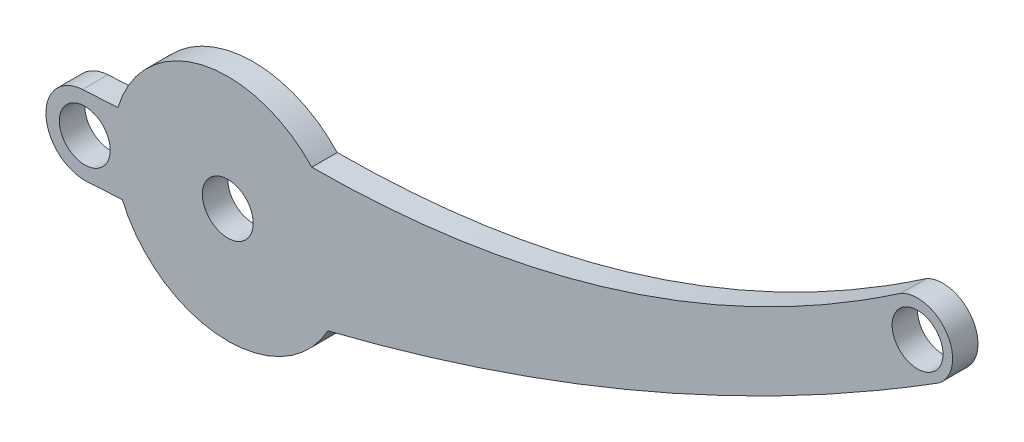
ISO-10303-21;
HEADER;
FILE_DESCRIPTION(('STEP AP214'),'2;1');
FILE_NAME('part.step','',(''),(''),'','','');
FILE_SCHEMA(('AUTOMOTIVE_DESIGN { 1 0 10303 214 1 1 1 1 }'));
ENDSEC;
DATA;
#1=APPLICATION_CONTEXT('core data for automotive mechanical design processes');
#2=APPLICATION_PROTOCOL_DEFINITION('international standard','automotive_design',2000,#1);
#3=PRODUCT_CONTEXT('',#1,'mechanical');
#4=PRODUCT('Part','Part','',(#3));
#5=PRODUCT_RELATED_PRODUCT_CATEGORY('part','',(#4));
#6=PRODUCT_DEFINITION_FORMATION('','',#4);
#7=PRODUCT_DEFINITION_CONTEXT('part definition',#1,'design');
#8=PRODUCT_DEFINITION('design','',#6,#7);
#9=PRODUCT_DEFINITION_SHAPE('','',#8);
#10=(LENGTH_UNIT() NAMED_UNIT(*) SI_UNIT(.MILLI.,.METRE.));
#11=(NAMED_UNIT(*) PLANE_ANGLE_UNIT() SI_UNIT($,.RADIAN.));
#12=(NAMED_UNIT(*) SI_UNIT($,.STERADIAN.) SOLID_ANGLE_UNIT());
#13=UNCERTAINTY_MEASURE_WITH_UNIT(LENGTH_MEASURE(1.E-05),#10,'distance_accuracy_value','');
#14=(GEOMETRIC_REPRESENTATION_CONTEXT(3) GLOBAL_UNCERTAINTY_ASSIGNED_CONTEXT((#13)) GLOBAL_UNIT_ASSIGNED_CONTEXT((#10,
#11,#12)) REPRESENTATION_CONTEXT('',''));
#15=CARTESIAN_POINT('',(0.,0.,0.));
#16=DIRECTION('',(0.,0.,1.));
#17=DIRECTION('',(1.,0.,0.));
#18=AXIS2_PLACEMENT_3D('',#15,#16,#17);
#19=CARTESIAN_POINT('',(0.,0.,-2.));
#20=DIRECTION('',(0.,0.,1.));
#21=DIRECTION('',(1.,0.,0.));
#22=AXIS2_PLACEMENT_3D('',#19,#20,#21);
#23=PLANE('',#22);
#24=CARTESIAN_POINT('',(0.,0.,-2.));
#25=DIRECTION('',(0.,0.,1.));
#26=DIRECTION('',(1.,0.,0.));
#27=AXIS2_PLACEMENT_3D('',#24,#25,#26);
#28=CIRCLE('',#27,4.);
#29=CARTESIAN_POINT('',(4.,0.,-2.));
#30=VERTEX_POINT('',#29);
#31=EDGE_CURVE('E177',#30,#30,#28,.T.);
#32=ORIENTED_EDGE('',*,*,#31,.T.);
#33=EDGE_LOOP('',(#32));
#34=FACE_BOUND('',#33,.T.);
#35=CARTESIAN_POINT('',(0.,0.,-2.));
#36=DIRECTION('',(0.,0.,1.));
#37=DIRECTION('',(1.,0.,0.));
#38=AXIS2_PLACEMENT_3D('',#35,#36,#37);
#39=CIRCLE('',#38,4.8);
#40=CARTESIAN_POINT('',(4.8,0.,-2.));
#41=VERTEX_POINT('',#40);
#42=EDGE_CURVE('E234',#41,#41,#39,.T.);
#43=ORIENTED_EDGE('',*,*,#42,.F.);
#44=EDGE_LOOP('',(#43));
#45=FACE_BOUND('',#44,.T.);
#46=ADVANCED_FACE('F33',(#34,#45),#23,.F.);
#47=CARTESIAN_POINT('',(-22.4867612509429,-1.28341643429853,-2.));
#48=DIRECTION('',(0.,0.,1.));
#49=DIRECTION('',(1.,0.,0.));
#50=AXIS2_PLACEMENT_3D('',#47,#48,#49);
#51=CIRCLE('',#50,4.);
#52=CARTESIAN_POINT('',(-18.4867612509429,-1.28341643429853,-2.));
#53=VERTEX_POINT('',#52);
#54=EDGE_CURVE('E186',#53,#53,#51,.T.);
#55=ORIENTED_EDGE('',*,*,#54,.T.);
#56=EDGE_LOOP('',(#55));
#57=FACE_BOUND('',#56,.T.);
#58=CARTESIAN_POINT('',(-22.4867612509429,-1.28341643429853,-2.));
#59=DIRECTION('',(0.,0.,1.));
#60=DIRECTION('',(1.,0.,0.));
#61=AXIS2_PLACEMENT_3D('',#58,#59,#60);
#62=CIRCLE('',#61,4.8);
#63=CARTESIAN_POINT('',(-17.6867612509429,-1.28341643429853,-2.));
#64=VERTEX_POINT('',#63);
#65=EDGE_CURVE('E229',#64,#64,#62,.T.);
#66=ORIENTED_EDGE('',*,*,#65,.F.);
#67=EDGE_LOOP('',(#66));
#68=FACE_BOUND('',#67,.T.);
#69=ADVANCED_FACE('F405',(#57,#68),#23,.F.);
#70=CARTESIAN_POINT('',(0.,0.,2.));
#71=DIRECTION('',(0.,0.,-1.));
#72=DIRECTION('',(-1.,0.,0.));
#73=AXIS2_PLACEMENT_3D('',#70,#71,#72);
#74=CYLINDRICAL_SURFACE('',#73,18.0203);
#75=CARTESIAN_POINT('',(0.,0.,-2.));
#76=DIRECTION('',(0.,0.,1.));
#77=DIRECTION('',(1.,0.,0.));
#78=AXIS2_PLACEMENT_3D('',#75,#76,#77);
#79=CIRCLE('',#78,18.0203);
#80=CARTESIAN_POINT('',(13.2124542812011,12.2540713216943,-2.));
#81=VERTEX_POINT('',#80);
#82=CARTESIAN_POINT('',(-17.273333041781,5.13450851763995,-2.));
#83=VERTEX_POINT('',#82);
#84=EDGE_CURVE('E153',#81,#83,#79,.T.);
#85=ORIENTED_EDGE('',*,*,#84,.T.);
#86=DIRECTION('',(0.,0.,-1.));
#87=VECTOR('',#86,1.);
#88=CARTESIAN_POINT('',(-17.273333041781,5.13450851763995,2.));
#89=LINE('',#88,#87);
#90=CARTESIAN_POINT('',(-17.273333041781,5.13450851763995,2.));
#91=VERTEX_POINT('',#90);
#92=EDGE_CURVE('E11',#91,#83,#89,.T.);
#93=ORIENTED_EDGE('',*,*,#92,.F.);
#94=CARTESIAN_POINT('',(0.,0.,2.));
#95=DIRECTION('',(0.,0.,1.));
#96=DIRECTION('',(1.,0.,0.));
#97=AXIS2_PLACEMENT_3D('',#94,#95,#96);
#98=CIRCLE('',#97,18.0203);
#99=CARTESIAN_POINT('',(13.2124542812011,12.2540713216943,2.));
#100=VERTEX_POINT('',#99);
#101=EDGE_CURVE('E95',#100,#91,#98,.T.);
#102=ORIENTED_EDGE('',*,*,#101,.F.);
#103=DIRECTION('',(0.,0.,-1.));
#104=VECTOR('',#103,1.);
#105=CARTESIAN_POINT('',(13.2124542812011,12.2540713216943,2.));
#106=LINE('',#105,#104);
#107=EDGE_CURVE('E57',#100,#81,#106,.T.);
#108=ORIENTED_EDGE('',*,*,#107,.T.);
#109=EDGE_LOOP('',(#85,#93,#102,#108));
#110=FACE_BOUND('',#109,.T.);
#111=ADVANCED_FACE('F212',(#110),#74,.T.);
#112=CARTESIAN_POINT('',(-0.348181835540796,6.10049988334476,2.));
#113=DIRECTION('',(-0.0569815796631457,0.998375229850527,0.));
#114=DIRECTION('',(-0.998375229850527,-0.0569815796631457,0.));
#115=AXIS2_PLACEMENT_3D('',#112,#113,#114);
#116=PLANE('',#115);
#117=DIRECTION('',(0.998375229850527,0.0569815796631457,0.));
#118=VECTOR('',#117,1.);
#119=CARTESIAN_POINT('',(-0.348181835540796,6.10049988334476,-2.));
#120=LINE('',#119,#118);
#121=CARTESIAN_POINT('',(-22.8349430864837,4.81708344904622,-2.));
#122=VERTEX_POINT('',#121);
#123=EDGE_CURVE('E155',#122,#83,#120,.T.);
#124=ORIENTED_EDGE('',*,*,#123,.F.);
#125=DIRECTION('',(0.,0.,-1.));
#126=VECTOR('',#125,1.);
#127=CARTESIAN_POINT('',(-22.8349430864837,4.81708344904622,2.));
#128=LINE('',#127,#126);
#129=CARTESIAN_POINT('',(-22.8349430864837,4.81708344904622,2.));
#130=VERTEX_POINT('',#129);
#131=EDGE_CURVE('E41',#130,#122,#128,.T.);
#132=ORIENTED_EDGE('',*,*,#131,.F.);
#133=DIRECTION('',(0.998375229850527,0.0569815796631457,0.));
#134=VECTOR('',#133,1.);
#135=CARTESIAN_POINT('',(-0.348181835540796,6.10049988334476,2.));
#136=LINE('',#135,#134);
#137=EDGE_CURVE('E211',#130,#91,#136,.T.);
#138=ORIENTED_EDGE('',*,*,#137,.T.);
#139=ORIENTED_EDGE('',*,*,#92,.T.);
#140=EDGE_LOOP('',(#124,#132,#138,#139));
#141=FACE_BOUND('',#140,.T.);
#142=ADVANCED_FACE('F35',(#141),#116,.T.);
#143=CARTESIAN_POINT('',(-22.4867612509429,-1.28341643429853,2.));
#144=DIRECTION('',(0.,0.,-1.));
#145=DIRECTION('',(-1.,0.,0.));
#146=AXIS2_PLACEMENT_3D('',#143,#144,#145);
#147=CYLINDRICAL_SURFACE('',#146,6.11042792423656);
#148=CARTESIAN_POINT('',(-22.4867612509429,-1.28341643429853,-2.));
#149=DIRECTION('',(0.,0.,1.));
#150=DIRECTION('',(1.,0.,0.));
#151=AXIS2_PLACEMENT_3D('',#148,#149,#150);
#152=CIRCLE('',#151,6.11042792423656);
#153=CARTESIAN_POINT('',(-22.1385794154021,-7.38391631764329,-2.));
#154=VERTEX_POINT('',#153);
#155=EDGE_CURVE('E160',#122,#154,#152,.T.);
#156=ORIENTED_EDGE('',*,*,#155,.T.);
#157=DIRECTION('',(0.,0.,-1.));
#158=VECTOR('',#157,1.);
#159=CARTESIAN_POINT('',(-22.1385794154021,-7.38391631764329,2.));
#160=LINE('',#159,#158);
#161=CARTESIAN_POINT('',(-22.1385794154021,-7.38391631764329,2.));
#162=VERTEX_POINT('',#161);
#163=EDGE_CURVE('E195',#162,#154,#160,.T.);
#164=ORIENTED_EDGE('',*,*,#163,.F.);
#165=CARTESIAN_POINT('',(-22.4867612509429,-1.28341643429853,2.));
#166=DIRECTION('',(0.,0.,1.));
#167=DIRECTION('',(1.,0.,0.));
#168=AXIS2_PLACEMENT_3D('',#165,#166,#167);
#169=CIRCLE('',#168,6.11042792423656);
#170=EDGE_CURVE('E202',#130,#162,#169,.T.);
#171=ORIENTED_EDGE('',*,*,#170,.F.);
#172=ORIENTED_EDGE('',*,*,#131,.T.);
#173=EDGE_LOOP('',(#156,#164,#171,#172));
#174=FACE_BOUND('',#173,.T.);
#175=ADVANCED_FACE('F200',(#174),#147,.T.);
#176=CARTESIAN_POINT('',(0.348181835540796,-6.10049988334476,2.));
#177=DIRECTION('',(-0.0569815796631458,0.998375229850527,0.));
#178=DIRECTION('',(-0.998375229850527,-0.0569815796631458,0.));
#179=AXIS2_PLACEMENT_3D('',#176,#177,#178);
#180=PLANE('',#179);
#181=DIRECTION('',(0.998375229850527,0.0569815796631458,0.));
#182=VECTOR('',#181,1.);
#183=CARTESIAN_POINT('',(0.348181835540796,-6.10049988334476,-2.));
#184=LINE('',#183,#182);
#185=CARTESIAN_POINT('',(-16.5769693706994,-7.06649124904957,-2.));
#186=VERTEX_POINT('',#185);
#187=EDGE_CURVE('E162',#154,#186,#184,.T.);
#188=ORIENTED_EDGE('',*,*,#187,.T.);
#189=DIRECTION('',(0.,0.,-1.));
#190=VECTOR('',#189,1.);
#191=CARTESIAN_POINT('',(-16.5769693706994,-7.06649124904957,2.));
#192=LINE('',#191,#190);
#193=CARTESIAN_POINT('',(-16.5769693706994,-7.06649124904957,2.));
#194=VERTEX_POINT('',#193);
#195=EDGE_CURVE('E192',#194,#186,#192,.T.);
#196=ORIENTED_EDGE('',*,*,#195,.F.);
#197=DIRECTION('',(0.998375229850527,0.0569815796631458,0.));
#198=VECTOR('',#197,1.);
#199=CARTESIAN_POINT('',(0.348181835540796,-6.10049988334476,2.));
#200=LINE('',#199,#198);
#201=EDGE_CURVE('E143',#162,#194,#200,.T.);
#202=ORIENTED_EDGE('',*,*,#201,.F.);
#203=ORIENTED_EDGE('',*,*,#163,.T.);
#204=EDGE_LOOP('',(#188,#196,#202,#203));
#205=FACE_BOUND('',#204,.T.);
#206=ADVANCED_FACE('F219',(#205),#180,.F.);
#207=CARTESIAN_POINT('',(15.7458990999388,-8.76343960009698,-2.));
#208=VERTEX_POINT('',#207);
#209=EDGE_CURVE('E157',#186,#208,#79,.T.);
#210=ORIENTED_EDGE('',*,*,#209,.T.);
#211=DIRECTION('',(0.,0.,-1.));
#212=VECTOR('',#211,1.);
#213=CARTESIAN_POINT('',(15.7458990999388,-8.76343960009698,2.));
#214=LINE('',#213,#212);
#215=CARTESIAN_POINT('',(15.7458990999388,-8.76343960009698,2.));
#216=VERTEX_POINT('',#215);
#217=EDGE_CURVE('E133',#216,#208,#214,.T.);
#218=ORIENTED_EDGE('',*,*,#217,.F.);
#219=EDGE_CURVE('E120',#194,#216,#98,.T.);
#220=ORIENTED_EDGE('',*,*,#219,.F.);
#221=ORIENTED_EDGE('',*,*,#195,.T.);
#222=EDGE_LOOP('',(#210,#218,#220,#221));
#223=FACE_BOUND('',#222,.T.);
#224=ADVANCED_FACE('F215',(#223),#74,.T.);
#225=CARTESIAN_POINT('',(14.7191388942277,-9.01954009833308,2.));
#226=CARTESIAN_POINT('',(15.2325189970833,-8.89148984921503,2.));
#227=CARTESIAN_POINT('',(15.7458990999388,-8.76343960009698,2.));
#228=CARTESIAN_POINT('',(67.0839093854893,4.0415853117079,2.));
#229=CARTESIAN_POINT('',(111.853607552858,32.1932057551996,2.));
#230=B_SPLINE_CURVE_WITH_KNOTS('',2,(#225,#226,#227,#228,#229),.UNSPECIFIED.,.F.,.F.,(3,2,3),
(-0.01,0.,1.),.UNSPECIFIED.);
#231=DIRECTION('',(0.,0.,-1.));
#232=VECTOR('',#231,1.);
#233=SURFACE_OF_LINEAR_EXTRUSION('',#230,#232);
#234=CARTESIAN_POINT('',(15.7458990999388,-8.76343960009698,-2.));
#235=CARTESIAN_POINT('',(67.0839093854893,4.0415853117079,-2.));
#236=CARTESIAN_POINT('',(111.853607552858,32.1932057551996,-2.));
#237=B_SPLINE_CURVE_WITH_KNOTS('',2,(#234,#235,#236),.UNSPECIFIED.,.F.,.F.,(3,3),(0.,1.),.UNSPECIFIED.);
#238=CARTESIAN_POINT('',(111.853607552858,32.1932057551996,-2.));
#239=VERTEX_POINT('',#238);
#240=EDGE_CURVE('E129',#208,#239,#237,.T.);
#241=ORIENTED_EDGE('',*,*,#240,.T.);
#242=DIRECTION('',(0.,0.,-1.));
#243=VECTOR('',#242,1.);
#244=CARTESIAN_POINT('',(111.853607552858,32.1932057551996,2.));
#245=LINE('',#244,#243);
#246=CARTESIAN_POINT('',(111.853607552858,32.1932057551996,2.));
#247=VERTEX_POINT('',#246);
#248=EDGE_CURVE('E126',#247,#239,#245,.T.);
#249=ORIENTED_EDGE('',*,*,#248,.F.);
#250=EDGE_CURVE('E112',#216,#247,#230,.T.);
#251=ORIENTED_EDGE('',*,*,#250,.F.);
#252=ORIENTED_EDGE('',*,*,#217,.T.);
#253=EDGE_LOOP('',(#241,#249,#251,#252));
#254=FACE_BOUND('',#253,.T.);
#255=ADVANCED_FACE('F127',(#254),#233,.F.);
#256=CARTESIAN_POINT('',(108.467020379199,36.5528887009727,2.));
#257=DIRECTION('',(0.,0.,-1.));
#258=DIRECTION('',(-1.,0.,0.));
#259=AXIS2_PLACEMENT_3D('',#256,#257,#258);
#260=CYLINDRICAL_SURFACE('',#259,5.52048983990184);
#261=CARTESIAN_POINT('',(108.467020379199,36.5528887009727,-2.));
#262=DIRECTION('',(0.,0.,1.));
#263=DIRECTION('',(1.,0.,0.));
#264=AXIS2_PLACEMENT_3D('',#261,#262,#263);
#265=CIRCLE('',#264,5.52048983990184);
#266=CARTESIAN_POINT('',(105.896265572367,41.4382779173619,-2.));
#267=VERTEX_POINT('',#266);
#268=EDGE_CURVE('E167',#239,#267,#265,.T.);
#269=ORIENTED_EDGE('',*,*,#268,.T.);
#270=DIRECTION('',(0.,0.,-1.));
#271=VECTOR('',#270,1.);
#272=CARTESIAN_POINT('',(105.896265572367,41.4382779173619,2.));
#273=LINE('',#272,#271);
#274=CARTESIAN_POINT('',(105.896265572367,41.4382779173619,2.));
#275=VERTEX_POINT('',#274);
#276=EDGE_CURVE('E134',#275,#267,#273,.T.);
#277=ORIENTED_EDGE('',*,*,#276,.F.);
#278=CARTESIAN_POINT('',(108.467020379199,36.5528887009727,2.));
#279=DIRECTION('',(0.,0.,1.));
#280=DIRECTION('',(1.,0.,0.));
#281=AXIS2_PLACEMENT_3D('',#278,#279,#280);
#282=CIRCLE('',#281,5.52048983990184);
#283=EDGE_CURVE('E117',#247,#275,#282,.T.);
#284=ORIENTED_EDGE('',*,*,#283,.F.);
#285=ORIENTED_EDGE('',*,*,#248,.T.);
#286=EDGE_LOOP('',(#269,#277,#284,#285));
#287=FACE_BOUND('',#286,.T.);
#288=ADVANCED_FACE('F136',(#287),#260,.T.);
#289=CARTESIAN_POINT('',(108.469927907344,36.4086715831056,2.));
#290=DIRECTION('',(0.,0.,-1.));
#291=DIRECTION('',(-1.,0.,0.));
#292=AXIS2_PLACEMENT_3D('',#289,#290,#291);
#293=CYLINDRICAL_SURFACE('',#292,4.00000000000001);
#294=CARTESIAN_POINT('',(108.469927907344,36.4086715831056,2.));
#295=DIRECTION('',(0.,0.,1.));
#296=DIRECTION('',(1.,0.,0.));
#297=AXIS2_PLACEMENT_3D('',#294,#295,#296);
#298=CIRCLE('',#297,4.00000000000001);
#299=CARTESIAN_POINT('',(112.469927907344,36.4086715831056,2.));
#300=VERTEX_POINT('',#299);
#301=EDGE_CURVE('E147',#300,#300,#298,.T.);
#302=ORIENTED_EDGE('',*,*,#301,.T.);
#303=EDGE_LOOP('',(#302));
#304=FACE_BOUND('',#303,.T.);
#305=CARTESIAN_POINT('',(108.469927907344,36.4086715831056,-2.));
#306=DIRECTION('',(0.,0.,1.));
#307=DIRECTION('',(1.,0.,0.));
#308=AXIS2_PLACEMENT_3D('',#305,#306,#307);
#309=CIRCLE('',#308,4.00000000000001);
#310=CARTESIAN_POINT('',(112.469927907344,36.4086715831056,-2.));
#311=VERTEX_POINT('',#310);
#312=EDGE_CURVE('E183',#311,#311,#309,.T.);
#313=ORIENTED_EDGE('',*,*,#312,.F.);
#314=EDGE_LOOP('',(#313));
#315=FACE_BOUND('',#314,.T.);
#316=ADVANCED_FACE('F401',(#304,#315),#293,.F.);
#317=CARTESIAN_POINT('',(0.,0.,2.));
#318=DIRECTION('',(0.,0.,-1.));
#319=DIRECTION('',(-1.,0.,0.));
#320=AXIS2_PLACEMENT_3D('',#317,#318,#319);
#321=CYLINDRICAL_SURFACE('',#320,4.);
#322=CARTESIAN_POINT('',(0.,0.,2.));
#323=DIRECTION('',(0.,0.,1.));
#324=DIRECTION('',(1.,0.,0.));
#325=AXIS2_PLACEMENT_3D('',#322,#323,#324);
#326=CIRCLE('',#325,4.);
#327=CARTESIAN_POINT('',(4.,0.,2.));
#328=VERTEX_POINT('',#327);
#329=EDGE_CURVE('E139',#328,#328,#326,.T.);
#330=ORIENTED_EDGE('',*,*,#329,.T.);
#331=EDGE_LOOP('',(#330));
#332=FACE_BOUND('',#331,.T.);
#333=ORIENTED_EDGE('',*,*,#31,.F.);
#334=EDGE_LOOP('',(#333));
#335=FACE_BOUND('',#334,.T.);
#336=ADVANCED_FACE('F579',(#332,#335),#321,.F.);
#337=CARTESIAN_POINT('',(12.2061843026016,12.2506708359892,2.));
#338=CARTESIAN_POINT('',(12.7093192919014,12.2523710788417,2.));
#339=CARTESIAN_POINT('',(13.2124542812011,12.2540713216943,2.));
#340=CARTESIAN_POINT('',(63.5259532111759,12.4240956069503,2.));
#341=CARTESIAN_POINT('',(105.896265572367,41.438277917362,2.));
#342=B_SPLINE_CURVE_WITH_KNOTS('',2,(#337,#338,#339,#340,#341),.UNSPECIFIED.,.F.,.F.,(3,2,3),
(-0.01,0.,1.),.UNSPECIFIED.);
#343=DIRECTION('',(0.,0.,-1.));
#344=VECTOR('',#343,1.);
#345=SURFACE_OF_LINEAR_EXTRUSION('',#342,#344);
#346=CARTESIAN_POINT('',(13.2124542812011,12.2540713216943,-2.));
#347=CARTESIAN_POINT('',(63.5259532111759,12.4240956069503,-2.));
#348=CARTESIAN_POINT('',(105.896265572367,41.438277917362,-2.));
#349=B_SPLINE_CURVE_WITH_KNOTS('',2,(#346,#347,#348),.UNSPECIFIED.,.F.,.F.,(3,3),(0.,1.),.UNSPECIFIED.);
#350=EDGE_CURVE('E172',#81,#267,#349,.T.);
#351=ORIENTED_EDGE('',*,*,#350,.F.);
#352=ORIENTED_EDGE('',*,*,#107,.F.);
#353=EDGE_CURVE('E137',#100,#275,#342,.T.);
#354=ORIENTED_EDGE('',*,*,#353,.T.);
#355=ORIENTED_EDGE('',*,*,#276,.T.);
#356=EDGE_LOOP('',(#351,#352,#354,#355));
#357=FACE_BOUND('',#356,.T.);
#358=ADVANCED_FACE('F213',(#357),#345,.T.);
#359=CARTESIAN_POINT('',(-22.4867612509429,-1.28341643429853,2.));
#360=DIRECTION('',(0.,0.,-1.));
#361=DIRECTION('',(-1.,0.,0.));
#362=AXIS2_PLACEMENT_3D('',#359,#360,#361);
#363=CYLINDRICAL_SURFACE('',#362,4.);
#364=CARTESIAN_POINT('',(-22.4867612509429,-1.28341643429853,2.));
#365=DIRECTION('',(0.,0.,1.));
#366=DIRECTION('',(1.,0.,0.));
#367=AXIS2_PLACEMENT_3D('',#364,#365,#366);
#368=CIRCLE('',#367,4.);
#369=CARTESIAN_POINT('',(-18.4867612509429,-1.28341643429853,2.));
#370=VERTEX_POINT('',#369);
#371=EDGE_CURVE('E150',#370,#370,#368,.T.);
#372=ORIENTED_EDGE('',*,*,#371,.T.);
#373=EDGE_LOOP('',(#372));
#374=FACE_BOUND('',#373,.T.);
#375=ORIENTED_EDGE('',*,*,#54,.F.);
#376=EDGE_LOOP('',(#375));
#377=FACE_BOUND('',#376,.T.);
#378=ADVANCED_FACE('F422',(#374,#377),#363,.F.);
#379=CARTESIAN_POINT('',(0.,0.,2.));
#380=DIRECTION('',(0.,0.,1.));
#381=DIRECTION('',(1.,0.,0.));
#382=AXIS2_PLACEMENT_3D('',#379,#380,#381);
#383=PLANE('',#382);
#384=ORIENTED_EDGE('',*,*,#101,.T.);
#385=ORIENTED_EDGE('',*,*,#137,.F.);
#386=ORIENTED_EDGE('',*,*,#170,.T.);
#387=ORIENTED_EDGE('',*,*,#201,.T.);
#388=ORIENTED_EDGE('',*,*,#219,.T.);
#389=ORIENTED_EDGE('',*,*,#250,.T.);
#390=ORIENTED_EDGE('',*,*,#283,.T.);
#391=ORIENTED_EDGE('',*,*,#353,.F.);
#392=EDGE_LOOP('',(#384,#385,#386,#387,#388,#389,#390,#391));
#393=FACE_BOUND('',#392,.T.);
#394=ORIENTED_EDGE('',*,*,#329,.F.);
#395=EDGE_LOOP('',(#394));
#396=FACE_BOUND('',#395,.T.);
#397=ORIENTED_EDGE('',*,*,#301,.F.);
#398=EDGE_LOOP('',(#397));
#399=FACE_BOUND('',#398,.T.);
#400=ORIENTED_EDGE('',*,*,#371,.F.);
#401=EDGE_LOOP('',(#400));
#402=FACE_BOUND('',#401,.T.);
#403=ADVANCED_FACE('F114',(#393,#396,#399,#402),#383,.T.);
#404=CARTESIAN_POINT('',(108.469927907344,36.4086715831056,-2.));
#405=DIRECTION('',(0.,0.,1.));
#406=DIRECTION('',(1.,0.,0.));
#407=AXIS2_PLACEMENT_3D('',#404,#405,#406);
#408=CIRCLE('',#407,4.80000000000001);
#409=CARTESIAN_POINT('',(112.386109536411,39.1841934165911,-2.));
#410=VERTEX_POINT('',#409);
#411=CARTESIAN_POINT('',(109.638433635041,31.7530734083981,-2.));
#412=VERTEX_POINT('',#411);
#413=EDGE_CURVE('E233',#410,#412,#408,.T.);
#414=ORIENTED_EDGE('',*,*,#413,.F.);
#415=CARTESIAN_POINT('',(108.467020379199,36.5528887009727,-2.));
#416=DIRECTION('',(0.,0.,1.));
#417=DIRECTION('',(1.,0.,0.));
#418=AXIS2_PLACEMENT_3D('',#415,#416,#417);
#419=CIRCLE('',#418,4.72048983990184);
#420=CARTESIAN_POINT('',(106.308377640235,40.7508984501449,-2.));
#421=VERTEX_POINT('',#420);
#422=EDGE_CURVE('E261',#410,#421,#419,.T.);
#423=ORIENTED_EDGE('',*,*,#422,.T.);
#424=CARTESIAN_POINT('',(12.859642213093,11.452874496878,-2.));
#425=CARTESIAN_POINT('',(12.9495945339256,11.453201462917,-2.));
#426=CARTESIAN_POINT('',(13.0395470513783,11.4534859166924,-2.));
#427=CARTESIAN_POINT('',(13.2194520249505,11.4540869334734,-2.));
#428=CARTESIAN_POINT('',(13.3094044810698,11.454403496498,-2.));
#429=CARTESIAN_POINT('',(13.579260991797,11.4555770502161,-2.));
#430=CARTESIAN_POINT('',(13.7591641138313,11.4566579054769,-2.));
#431=CARTESIAN_POINT('',(14.2988657189595,11.4607179142231,-2.));
#432=CARTESIAN_POINT('',(14.6586582820398,11.4645145133677,-2.));
#433=CARTESIAN_POINT('',(15.7379928541229,11.4792467282622,-2.));
#434=CARTESIAN_POINT('',(16.4574898295549,11.493524759054,-2.));
#435=CARTESIAN_POINT('',(18.6157537149257,11.5498164869784,-2.));
#436=CARTESIAN_POINT('',(20.0541937875128,11.6052877056458,-2.));
#437=CARTESIAN_POINT('',(22.9292232394847,11.752740931204,-2.));
#438=CARTESIAN_POINT('',(24.3658125766494,11.8447237567259,-2.));
#439=CARTESIAN_POINT('',(27.2355061680929,12.0656686712827,-2.));
#440=CARTESIAN_POINT('',(28.6686116955024,12.1946141727377,-2.));
#441=CARTESIAN_POINT('',(31.530930481826,12.4899342449735,-2.));
#442=CARTESIAN_POINT('',(32.9601438307795,12.6563079423379,-2.));
#443=CARTESIAN_POINT('',(35.813665083346,13.0268250401974,-2.));
#444=CARTESIAN_POINT('',(37.237973004658,13.2309683042724,-2.));
#445=CARTESIAN_POINT('',(40.0816432267526,13.6774229710999,-2.));
#446=CARTESIAN_POINT('',(41.5010012524372,13.919761618477,-2.));
#447=CARTESIAN_POINT('',(44.3326760726159,14.4426340167602,-2.));
#448=CARTESIAN_POINT('',(45.7449928230375,14.7231680064266,-2.));
#449=CARTESIAN_POINT('',(48.5614722139665,15.3224439279395,-2.));
#450=CARTESIAN_POINT('',(49.9656350004468,15.6411851735724,-2.));
#451=CARTESIAN_POINT('',(52.76521097096,16.3168932193592,-2.));
#452=CARTESIAN_POINT('',(54.1606211936826,16.6738722885911,-2.));
#453=CARTESIAN_POINT('',(56.9412175256635,17.4257730128226,-2.));
#454=CARTESIAN_POINT('',(58.3264034176538,17.8206954716373,-2.));
#455=CARTESIAN_POINT('',(61.0855864474752,18.6481787126763,-2.));
#456=CARTESIAN_POINT('',(62.4595827172334,19.0807423851934,-2.));
#457=CARTESIAN_POINT('',(65.7095841030826,20.1526865444119,-2.));
#458=CARTESIAN_POINT('',(67.5801342156652,20.8086848991946,-2.));
#459=CARTESIAN_POINT('',(71.2960277806776,22.1898235228041,-2.));
#460=CARTESIAN_POINT('',(73.1413647600542,22.914981179491,-2.));
#461=CARTESIAN_POINT('',(76.8046497190166,24.43271453534,-2.));
#462=CARTESIAN_POINT('',(78.622590589226,25.2253073912285,-2.));
#463=CARTESIAN_POINT('',(82.2289980658683,26.8758319833007,-2.));
#464=CARTESIAN_POINT('',(84.0174585410265,27.7337771078636,-2.));
#465=CARTESIAN_POINT('',(87.5676178409756,29.5149325792297,-2.));
#466=CARTESIAN_POINT('',(89.3292312010002,30.4383131713733,-2.));
#467=CARTESIAN_POINT('',(92.8190856407004,32.3456018293665,-2.));
#468=CARTESIAN_POINT('',(94.5473307079871,33.3295026033107,-2.));
#469=CARTESIAN_POINT('',(97.9688530927804,35.3548510880444,-2.));
#470=CARTESIAN_POINT('',(99.662143310379,36.3962770280571,-2.));
#471=CARTESIAN_POINT('',(103.012380142205,38.533428459072,-2.));
#472=CARTESIAN_POINT('',(104.669352335866,39.6291138372399,-2.));
#473=CARTESIAN_POINT('',(106.308377640235,40.7508984501449,-2.));
#474=B_SPLINE_CURVE_WITH_KNOTS('',3,(#424,#425,#426,#427,#428,#429,#430,#431,#432,#433,#434,
#435,#436,#437,#438,#439,#440,#441,#442,#443,#444,#445,#446,#447,#448,#449,#450,#451,#452,#453,
#454,#455,#456,#457,#458,#459,#460,#461,#462,#463,#464,#465,#466,#467,#468,#469,#470,#471,#472,
#473),.UNSPECIFIED.,.F.,.F.,(4,2,2,2,2,2,2,2,2,2,2,2,2,2,2,2,2,2,2,2,2,2,2,2,4),(0.,
0.269858839453504,0.53971783761849,1.07943605877521,2.15886697829503,4.31773456613703,
8.63576904740112,12.9539003493044,17.2700968477591,21.5861926348242,25.9022728328643,
30.2214457251091,34.5406456178829,38.8597679481636,43.1802802971823,47.5008841946673,
51.8218201443633,57.7671044950213,63.7138875546772,69.6621881331006,75.6117106033703,
81.5773246202079,87.5422212597456,93.5048757092605,99.4631860537547),.UNSPECIFIED.);
#475=CARTESIAN_POINT('',(12.859642213093,11.452874496878,-2.));
#476=VERTEX_POINT('',#475);
#477=EDGE_CURVE('E237',#476,#421,#474,.T.);
#478=ORIENTED_EDGE('',*,*,#477,.F.);
#479=CARTESIAN_POINT('',(0.,0.,-2.));
#480=DIRECTION('',(0.,0.,1.));
#481=DIRECTION('',(1.,0.,0.));
#482=AXIS2_PLACEMENT_3D('',#479,#480,#481);
#483=CIRCLE('',#482,17.2203);
#484=CARTESIAN_POINT('',(-16.657009441208,4.36838283183924,-2.));
#485=VERTEX_POINT('',#484);
#486=EDGE_CURVE('E48',#476,#485,#483,.T.);
#487=ORIENTED_EDGE('',*,*,#486,.T.);
#488=DIRECTION('',(0.998375229850527,0.0569815796631457,0.));
#489=VECTOR('',#488,1.);
#490=CARTESIAN_POINT('',(-0.302596571810279,5.30179969946433,-2.));
#491=LINE('',#490,#489);
#492=CARTESIAN_POINT('',(-22.7893578227532,4.0183832651658,-2.));
#493=VERTEX_POINT('',#492);
#494=EDGE_CURVE('E240',#493,#485,#491,.T.);
#495=ORIENTED_EDGE('',*,*,#494,.F.);
#496=CARTESIAN_POINT('',(-22.4867612509429,-1.28341643429853,-2.));
#497=DIRECTION('',(0.,0.,1.));
#498=DIRECTION('',(1.,0.,0.));
#499=AXIS2_PLACEMENT_3D('',#496,#497,#498);
#500=CIRCLE('',#499,5.31042792423656);
#501=CARTESIAN_POINT('',(-22.1841646791326,-6.58521613376287,-2.));
#502=VERTEX_POINT('',#501);
#503=EDGE_CURVE('E243',#493,#502,#500,.T.);
#504=ORIENTED_EDGE('',*,*,#503,.T.);
#505=DIRECTION('',(0.998375229850527,0.0569815796631458,0.));
#506=VECTOR('',#505,1.);
#507=CARTESIAN_POINT('',(0.30259657181028,-5.30179969946433,-2.));
#508=LINE('',#507,#506);
#509=CARTESIAN_POINT('',(-16.0518162975874,-6.23521656708943,-2.));
#510=VERTEX_POINT('',#509);
#511=EDGE_CURVE('E246',#502,#510,#508,.T.);
#512=ORIENTED_EDGE('',*,*,#511,.T.);
#513=CARTESIAN_POINT('',(0.,0.,-2.));
#514=DIRECTION('',(0.,0.,1.));
#515=DIRECTION('',(1.,0.,0.));
#516=AXIS2_PLACEMENT_3D('',#513,#514,#515);
#517=CIRCLE('',#516,17.2203);
#518=CARTESIAN_POINT('',(15.2110537390435,-8.0723340018815,-2.));
#519=VERTEX_POINT('',#518);
#520=EDGE_CURVE('E249',#510,#519,#517,.T.);
#521=ORIENTED_EDGE('',*,*,#520,.T.);
#522=CARTESIAN_POINT('',(15.2110537390435,-8.0723340018815,-2.));
#523=CARTESIAN_POINT('',(15.2781309999193,-8.05559163224466,-2.));
#524=CARTESIAN_POINT('',(15.3452124556635,-8.03886607512247,-2.));
#525=CARTESIAN_POINT('',(15.4793749045165,-8.00541305715933,-2.));
#526=CARTESIAN_POINT('',(15.5464558976252,-7.98868559631806,-2.));
#527=CARTESIAN_POINT('',(15.7476848702331,-7.938447073593,-2.));
#528=CARTESIAN_POINT('',(15.8818188426724,-7.90487987159289,-2.));
#529=CARTESIAN_POINT('',(16.2841579817841,-7.80392805725807,-2.));
#530=CARTESIAN_POINT('',(16.5523003823949,-7.73629323357363,-2.));
#531=CARTESIAN_POINT('',(17.3564765878034,-7.53240593082009,-2.));
#532=CARTESIAN_POINT('',(17.8922613527686,-7.39517013415682,-2.));
#533=CARTESIAN_POINT('',(19.4985940702705,-6.97951275050484,-2.));
#534=CARTESIAN_POINT('',(20.5681204639807,-6.69714116524389,-2.));
#535=CARTESIAN_POINT('',(23.7724441604953,-5.83420494672116,-2.));
#536=CARTESIAN_POINT('',(25.9030028570846,-5.23781466091569,-2.));
#537=CARTESIAN_POINT('',(30.1516378937896,-4.00279704808784,-2.));
#538=CARTESIAN_POINT('',(32.2697152532843,-3.3641732239401,-2.));
#539=CARTESIAN_POINT('',(36.4926551499398,-2.04461080266265,-2.));
#540=CARTESIAN_POINT('',(38.5975176795778,-1.3636721814464,-2.));
#541=CARTESIAN_POINT('',(42.7932818605025,0.0405406997907452,-2.));
#542=CARTESIAN_POINT('',(44.8841822556069,0.76381871343064,-2.));
#543=CARTESIAN_POINT('',(49.0508998827474,2.2525374289306,-2.));
#544=CARTESIAN_POINT('',(51.1267172406657,3.01797777844802,-2.));
#545=CARTESIAN_POINT('',(55.2625366552552,4.59090169251761,-2.));
#546=CARTESIAN_POINT('',(57.3225375607435,5.3983882846894,-2.));
#547=CARTESIAN_POINT('',(61.4257483167694,7.05512121174084,-2.));
#548=CARTESIAN_POINT('',(63.4689575940041,7.90436896558104,-2.));
#549=CARTESIAN_POINT('',(68.151795080661,9.90690375620341,-2.));
#550=CARTESIAN_POINT('',(70.7852827944171,11.0745852945427,-2.));
#551=CARTESIAN_POINT('',(76.0206465676522,13.4793601182899,-2.));
#552=CARTESIAN_POINT('',(78.6225196849907,14.7164598046569,-2.));
#553=CARTESIAN_POINT('',(83.7928523822564,17.2589696692763,-2.));
#554=CARTESIAN_POINT('',(86.3613101205048,18.5643835929001,-2.));
#555=CARTESIAN_POINT('',(91.4652054695496,21.2433226883933,-2.));
#556=CARTESIAN_POINT('',(94.0006135072397,22.616904194798,-2.));
#557=CARTESIAN_POINT('',(99.0345934679894,25.429676491094,-2.));
#558=CARTESIAN_POINT('',(101.533167250702,26.8688639536182,-2.));
#559=CARTESIAN_POINT('',(106.492000418718,29.8111334902305,-2.));
#560=CARTESIAN_POINT('',(108.952264415863,31.3142077909066,-2.));
#561=CARTESIAN_POINT('',(111.392872146543,32.8485107823267,-2.));
#562=B_SPLINE_CURVE_WITH_KNOTS('',3,(#522,#523,#524,#525,#526,#527,#528,#529,#530,#531,#532,
#533,#534,#535,#536,#537,#538,#539,#540,#541,#542,#543,#544,#545,#546,#547,#548,#549,#550,#551,
#552,#553,#554,#555,#556,#557,#558,#559,#560,#561),.UNSPECIFIED.,.F.,.F.,(4,2,2,2,2,2,2,2,2,2,2,
2,2,2,2,2,2,2,2,4),(0.,0.207405382742665,0.414810801083817,0.829621638822687,1.65924327675955,
3.31848050463551,6.63695490299736,13.2738515369675,19.9101983915145,26.5465490236538,
33.1834888982967,39.8203733177031,46.4577363012489,53.0953249651243,61.7365297810555,
70.3785327050142,79.0210099296754,87.6707523663718,96.3200565971944,104.968311422419),.UNSPECIFIED.);
#563=EDGE_CURVE('E252',#519,#412,#562,.T.);
#564=ORIENTED_EDGE('',*,*,#563,.T.);
#565=EDGE_LOOP('',(#414,#423,#478,#487,#495,#504,#512,#521,#564));
#566=FACE_BOUND('',#565,.T.);
#567=ORIENTED_EDGE('',*,*,#84,.F.);
#568=ORIENTED_EDGE('',*,*,#350,.T.);
#569=ORIENTED_EDGE('',*,*,#268,.F.);
#570=ORIENTED_EDGE('',*,*,#240,.F.);
#571=ORIENTED_EDGE('',*,*,#209,.F.);
#572=ORIENTED_EDGE('',*,*,#187,.F.);
#573=ORIENTED_EDGE('',*,*,#155,.F.);
#574=ORIENTED_EDGE('',*,*,#123,.T.);
#575=EDGE_LOOP('',(#567,#568,#569,#570,#571,#572,#573,#574));
#576=FACE_BOUND('',#575,.T.);
#577=ORIENTED_EDGE('',*,*,#312,.T.);
#578=EDGE_LOOP('',(#577));
#579=FACE_BOUND('',#578,.T.);
#580=ADVANCED_FACE('F208',(#566,#576,#579),#23,.F.);
#581=CARTESIAN_POINT('',(0.,0.,2.));
#582=DIRECTION('',(0.,0.,-1.));
#583=DIRECTION('',(-1.,0.,0.));
#584=AXIS2_PLACEMENT_3D('',#581,#582,#583);
#585=CYLINDRICAL_SURFACE('',#584,17.2203);
#586=ORIENTED_EDGE('',*,*,#486,.F.);
#587=DIRECTION('',(0.,0.,-1.));
#588=VECTOR('',#587,1.);
#589=CARTESIAN_POINT('',(12.859642213093,11.452874496878,1.2));
#590=LINE('',#589,#588);
#591=CARTESIAN_POINT('',(12.859642213093,11.452874496878,1.2));
#592=VERTEX_POINT('',#591);
#593=EDGE_CURVE('E309',#592,#476,#590,.T.);
#594=ORIENTED_EDGE('',*,*,#593,.F.);
#595=CARTESIAN_POINT('',(0.,0.,1.2));
#596=DIRECTION('',(0.,0.,1.));
#597=DIRECTION('',(1.,0.,0.));
#598=AXIS2_PLACEMENT_3D('',#595,#596,#597);
#599=CIRCLE('',#598,17.2203);
#600=CARTESIAN_POINT('',(-16.657009441208,4.36838283183924,1.2));
#601=VERTEX_POINT('',#600);
#602=EDGE_CURVE('E232',#592,#601,#599,.T.);
#603=ORIENTED_EDGE('',*,*,#602,.T.);
#604=DIRECTION('',(0.,0.,-1.));
#605=VECTOR('',#604,1.);
#606=CARTESIAN_POINT('',(-16.657009441208,4.36838283183924,1.2));
#607=LINE('',#606,#605);
#608=EDGE_CURVE('E228',#601,#485,#607,.T.);
#609=ORIENTED_EDGE('',*,*,#608,.T.);
#610=EDGE_LOOP('',(#586,#594,#603,#609));
#611=FACE_BOUND('',#610,.T.);
#612=ADVANCED_FACE('F288',(#611),#585,.F.);
#613=CARTESIAN_POINT('',(-0.302596571810279,5.30179969946433,2.));
#614=DIRECTION('',(-0.0569815796631457,0.998375229850527,0.));
#615=DIRECTION('',(-0.998375229850527,-0.0569815796631457,0.));
#616=AXIS2_PLACEMENT_3D('',#613,#614,#615);
#617=PLANE('',#616);
#618=ORIENTED_EDGE('',*,*,#494,.T.);
#619=ORIENTED_EDGE('',*,*,#608,.F.);
#620=DIRECTION('',(0.998375229850527,0.0569815796631457,0.));
#621=VECTOR('',#620,1.);
#622=CARTESIAN_POINT('',(-0.302596571810279,5.30179969946433,1.2));
#623=LINE('',#622,#621);
#624=CARTESIAN_POINT('',(-22.7893578227532,4.0183832651658,1.2));
#625=VERTEX_POINT('',#624);
#626=EDGE_CURVE('E325',#625,#601,#623,.T.);
#627=ORIENTED_EDGE('',*,*,#626,.F.);
#628=DIRECTION('',(0.,0.,-1.));
#629=VECTOR('',#628,1.);
#630=CARTESIAN_POINT('',(-22.7893578227532,4.0183832651658,2.));
#631=LINE('',#630,#629);
#632=EDGE_CURVE('E321',#625,#493,#631,.T.);
#633=ORIENTED_EDGE('',*,*,#632,.T.);
#634=EDGE_LOOP('',(#618,#619,#627,#633));
#635=FACE_BOUND('',#634,.T.);
#636=ADVANCED_FACE('F381',(#635),#617,.F.);
#637=CARTESIAN_POINT('',(-22.4867612509429,-1.28341643429853,2.));
#638=DIRECTION('',(0.,0.,-1.));
#639=DIRECTION('',(-1.,0.,0.));
#640=AXIS2_PLACEMENT_3D('',#637,#638,#639);
#641=CYLINDRICAL_SURFACE('',#640,5.31042792423656);
#642=ORIENTED_EDGE('',*,*,#503,.F.);
#643=ORIENTED_EDGE('',*,*,#632,.F.);
#644=CARTESIAN_POINT('',(-22.4867612509429,-1.28341643429853,1.2));
#645=DIRECTION('',(0.,0.,1.));
#646=DIRECTION('',(1.,0.,0.));
#647=AXIS2_PLACEMENT_3D('',#644,#645,#646);
#648=CIRCLE('',#647,5.31042792423656);
#649=CARTESIAN_POINT('',(-22.1841646791326,-6.58521613376287,1.2));
#650=VERTEX_POINT('',#649);
#651=EDGE_CURVE('E328',#625,#650,#648,.T.);
#652=ORIENTED_EDGE('',*,*,#651,.T.);
#653=DIRECTION('',(0.,0.,1.));
#654=VECTOR('',#653,1.);
#655=CARTESIAN_POINT('',(-22.1841646791326,-6.58521613376287,2.));
#656=LINE('',#655,#654);
#657=EDGE_CURVE('E324',#650,#502,#656,.F.);
#658=ORIENTED_EDGE('',*,*,#657,.T.);
#659=EDGE_LOOP('',(#642,#643,#652,#658));
#660=FACE_BOUND('',#659,.T.);
#661=ADVANCED_FACE('F450',(#660),#641,.F.);
#662=CARTESIAN_POINT('',(0.30259657181028,-5.30179969946433,2.));
#663=DIRECTION('',(-0.0569815796631458,0.998375229850527,0.));
#664=DIRECTION('',(-0.998375229850527,-0.0569815796631458,0.));
#665=AXIS2_PLACEMENT_3D('',#662,#663,#664);
#666=PLANE('',#665);
#667=ORIENTED_EDGE('',*,*,#511,.F.);
#668=ORIENTED_EDGE('',*,*,#657,.F.);
#669=DIRECTION('',(0.998375229850527,0.0569815796631458,0.));
#670=VECTOR('',#669,1.);
#671=CARTESIAN_POINT('',(0.30259657181028,-5.30179969946433,1.2));
#672=LINE('',#671,#670);
#673=CARTESIAN_POINT('',(-16.0518162975874,-6.23521656708943,1.2));
#674=VERTEX_POINT('',#673);
#675=EDGE_CURVE('E334',#650,#674,#672,.T.);
#676=ORIENTED_EDGE('',*,*,#675,.T.);
#677=DIRECTION('',(0.,0.,-1.));
#678=VECTOR('',#677,1.);
#679=CARTESIAN_POINT('',(-16.0518162975874,-6.23521656708943,1.2));
#680=LINE('',#679,#678);
#681=EDGE_CURVE('E331',#674,#510,#680,.T.);
#682=ORIENTED_EDGE('',*,*,#681,.T.);
#683=EDGE_LOOP('',(#667,#668,#676,#682));
#684=FACE_BOUND('',#683,.T.);
#685=ADVANCED_FACE('F457',(#684),#666,.T.);
#686=ORIENTED_EDGE('',*,*,#520,.F.);
#687=ORIENTED_EDGE('',*,*,#681,.F.);
#688=CARTESIAN_POINT('',(0.,0.,1.2));
#689=DIRECTION('',(0.,0.,1.));
#690=DIRECTION('',(1.,0.,0.));
#691=AXIS2_PLACEMENT_3D('',#688,#689,#690);
#692=CIRCLE('',#691,17.2203);
#693=CARTESIAN_POINT('',(15.2110537390435,-8.07233400188149,1.2));
#694=VERTEX_POINT('',#693);
#695=EDGE_CURVE('E339',#674,#694,#692,.T.);
#696=ORIENTED_EDGE('',*,*,#695,.T.);
#697=DIRECTION('',(0.,0.,-1.));
#698=VECTOR('',#697,1.);
#699=CARTESIAN_POINT('',(15.2110537390435,-8.07233400188149,1.2));
#700=LINE('',#699,#698);
#701=EDGE_CURVE('E317',#694,#519,#700,.T.);
#702=ORIENTED_EDGE('',*,*,#701,.T.);
#703=EDGE_LOOP('',(#686,#687,#696,#702));
#704=FACE_BOUND('',#703,.T.);
#705=ADVANCED_FACE('F421',(#704),#585,.F.);
#706=CARTESIAN_POINT('',(14.7191388942277,-9.01954009833308,2.));
#707=CARTESIAN_POINT('',(15.2325189970833,-8.89148984921503,2.));
#708=CARTESIAN_POINT('',(67.0839093854893,4.0415853117079,2.));
#709=CARTESIAN_POINT('',(111.853607552858,32.1932057551996,2.));
#710=B_SPLINE_CURVE_WITH_KNOTS('',2,(#706,#707,#708,#709),.UNSPECIFIED.,.F.,.F.,(3,1,3),(-0.01,
0.,1.),.UNSPECIFIED.);
#711=DIRECTION('',(0.,0.,-1.));
#712=VECTOR('',#711,1.);
#713=SURFACE_OF_LINEAR_EXTRUSION('',#710,#712);
#714=OFFSET_SURFACE('',#713,0.8,.F.);
#715=DIRECTION('',(0.,0.,-1.));
#716=VECTOR('',#715,1.);
#717=CARTESIAN_POINT('',(109.638433635041,31.753073408398,-2.));
#718=LINE('',#717,#716);
#719=CARTESIAN_POINT('',(109.638433635041,31.7530734083981,1.2));
#720=VERTEX_POINT('',#719);
#721=EDGE_CURVE('E156',#720,#412,#718,.T.);
#722=ORIENTED_EDGE('',*,*,#721,.T.);
#723=ORIENTED_EDGE('',*,*,#563,.F.);
#724=ORIENTED_EDGE('',*,*,#701,.F.);
#725=CARTESIAN_POINT('',(15.2110537390435,-8.07233400188149,1.2));
#726=CARTESIAN_POINT('',(15.2781309999193,-8.05559163224466,1.2));
#727=CARTESIAN_POINT('',(15.3452124556635,-8.03886607512247,1.2));
#728=CARTESIAN_POINT('',(15.4793749045165,-8.00541305715933,1.2));
#729=CARTESIAN_POINT('',(15.5464558976252,-7.98868559631806,1.2));
#730=CARTESIAN_POINT('',(15.7476848702331,-7.938447073593,1.2));
#731=CARTESIAN_POINT('',(15.8818188426724,-7.90487987159289,1.2));
#732=CARTESIAN_POINT('',(16.284157981784,-7.80392805725807,1.2));
#733=CARTESIAN_POINT('',(16.5523003823949,-7.73629323357364,1.2));
#734=CARTESIAN_POINT('',(17.3564765878034,-7.5324059308201,1.2));
#735=CARTESIAN_POINT('',(17.8922613527686,-7.39517013415682,1.2));
#736=CARTESIAN_POINT('',(19.4985940702705,-6.97951275050484,1.2));
#737=CARTESIAN_POINT('',(20.5681204639807,-6.69714116524388,1.2));
#738=CARTESIAN_POINT('',(23.7724441604953,-5.83420494672116,1.2));
#739=CARTESIAN_POINT('',(25.9030028570846,-5.23781466091569,1.2));
#740=CARTESIAN_POINT('',(30.1516378937896,-4.00279704808784,1.2));
#741=CARTESIAN_POINT('',(32.2697152532843,-3.3641732239401,1.2));
#742=CARTESIAN_POINT('',(36.4926551499399,-2.04461080266264,1.2));
#743=CARTESIAN_POINT('',(38.5975176795778,-1.3636721814464,1.2));
#744=CARTESIAN_POINT('',(42.7932818605025,0.0405406997907474,1.2));
#745=CARTESIAN_POINT('',(44.8841822556069,0.763818713430645,1.2));
#746=CARTESIAN_POINT('',(49.0508998827475,2.25253742893061,1.2));
#747=CARTESIAN_POINT('',(51.1267172406657,3.01797777844803,1.2));
#748=CARTESIAN_POINT('',(55.2625366552552,4.59090169251762,1.2));
#749=CARTESIAN_POINT('',(57.3225375607436,5.39838828468942,1.2));
#750=CARTESIAN_POINT('',(61.4257483167694,7.05512121174085,1.2));
#751=CARTESIAN_POINT('',(63.4689575940041,7.90436896558105,1.2));
#752=CARTESIAN_POINT('',(68.151795080661,9.90690375620341,1.2));
#753=CARTESIAN_POINT('',(70.7852827944171,11.0745852945427,1.2));
#754=CARTESIAN_POINT('',(76.0206465676522,13.4793601182899,1.2));
#755=CARTESIAN_POINT('',(78.6225196849907,14.7164598046569,1.2));
#756=CARTESIAN_POINT('',(83.7928523822564,17.2589696692763,1.2));
#757=CARTESIAN_POINT('',(86.3613101205048,18.5643835929001,1.2));
#758=CARTESIAN_POINT('',(91.4652054695496,21.2433226883933,1.2));
#759=CARTESIAN_POINT('',(94.0006135072397,22.616904194798,1.2));
#760=CARTESIAN_POINT('',(99.0345934679894,25.429676491094,1.2));
#761=CARTESIAN_POINT('',(101.533167250702,26.8688639536182,1.2));
#762=CARTESIAN_POINT('',(106.492000418718,29.8111334902305,1.2));
#763=CARTESIAN_POINT('',(108.952264415863,31.3142077909066,1.2));
#764=CARTESIAN_POINT('',(111.392872146543,32.8485107823267,1.2));
#765=B_SPLINE_CURVE_WITH_KNOTS('',3,(#725,#726,#727,#728,#729,#730,#731,#732,#733,#734,#735,
#736,#737,#738,#739,#740,#741,#742,#743,#744,#745,#746,#747,#748,#749,#750,#751,#752,#753,#754,
#755,#756,#757,#758,#759,#760,#761,#762,#763,#764),.UNSPECIFIED.,.F.,.F.,(4,2,2,2,2,2,2,2,2,2,2,
2,2,2,2,2,2,2,2,4),(0.,0.207405382742663,0.414810801083815,0.82962163882269,1.65924327675955,
3.3184805046355,6.63695490299736,13.2738515369675,19.9101983915145,26.5465490236538,
33.1834888982967,39.8203733177031,46.457736301249,53.0953249651243,61.7365297810555,
70.3785327050142,79.0210099296754,87.6707523663718,96.3200565971943,104.968311422419),.UNSPECIFIED.);
#766=EDGE_CURVE('E344',#694,#720,#765,.T.);
#767=ORIENTED_EDGE('',*,*,#766,.T.);
#768=EDGE_LOOP('',(#722,#723,#724,#767));
#769=FACE_BOUND('',#768,.T.);
#770=ADVANCED_FACE('F263',(#769),#714,.T.);
#771=CARTESIAN_POINT('',(108.467020379199,36.5528887009727,2.));
#772=DIRECTION('',(0.,0.,-1.));
#773=DIRECTION('',(-1.,0.,0.));
#774=AXIS2_PLACEMENT_3D('',#771,#772,#773);
#775=CYLINDRICAL_SURFACE('',#774,4.72048983990184);
#776=CARTESIAN_POINT('',(108.467020379199,36.5528887009727,1.2));
#777=DIRECTION('',(0.,0.,1.));
#778=DIRECTION('',(1.,0.,0.));
#779=AXIS2_PLACEMENT_3D('',#776,#777,#778);
#780=CIRCLE('',#779,4.72048983990184);
#781=CARTESIAN_POINT('',(112.386109536411,39.1841934165911,1.2));
#782=VERTEX_POINT('',#781);
#783=CARTESIAN_POINT('',(106.308377640235,40.7508984501449,1.2));
#784=VERTEX_POINT('',#783);
#785=EDGE_CURVE('E301',#782,#784,#780,.T.);
#786=ORIENTED_EDGE('',*,*,#785,.T.);
#787=DIRECTION('',(0.,0.,-1.));
#788=VECTOR('',#787,1.);
#789=CARTESIAN_POINT('',(106.308377640235,40.7508984501449,1.2));
#790=LINE('',#789,#788);
#791=EDGE_CURVE('E312',#784,#421,#790,.T.);
#792=ORIENTED_EDGE('',*,*,#791,.T.);
#793=ORIENTED_EDGE('',*,*,#422,.F.);
#794=DIRECTION('',(0.,0.,-1.));
#795=VECTOR('',#794,1.);
#796=CARTESIAN_POINT('',(112.386109536411,39.1841934165911,2.));
#797=LINE('',#796,#795);
#798=EDGE_CURVE('E225',#782,#410,#797,.T.);
#799=ORIENTED_EDGE('',*,*,#798,.F.);
#800=EDGE_LOOP('',(#786,#792,#793,#799));
#801=FACE_BOUND('',#800,.T.);
#802=ADVANCED_FACE('F360',(#801),#775,.F.);
#803=CARTESIAN_POINT('',(108.469927907344,36.4086715831056,2.));
#804=DIRECTION('',(0.,0.,-1.));
#805=DIRECTION('',(-1.,0.,0.));
#806=AXIS2_PLACEMENT_3D('',#803,#804,#805);
#807=CYLINDRICAL_SURFACE('',#806,4.80000000000001);
#808=CARTESIAN_POINT('',(108.469927907344,36.4086715831056,1.2));
#809=DIRECTION('',(0.,0.,1.));
#810=DIRECTION('',(1.,0.,0.));
#811=AXIS2_PLACEMENT_3D('',#808,#809,#810);
#812=CIRCLE('',#811,4.80000000000001);
#813=EDGE_CURVE('E305',#782,#720,#812,.T.);
#814=ORIENTED_EDGE('',*,*,#813,.F.);
#815=ORIENTED_EDGE('',*,*,#798,.T.);
#816=ORIENTED_EDGE('',*,*,#413,.T.);
#817=ORIENTED_EDGE('',*,*,#721,.F.);
#818=EDGE_LOOP('',(#814,#815,#816,#817));
#819=FACE_BOUND('',#818,.T.);
#820=ADVANCED_FACE('F428',(#819),#807,.T.);
#821=CARTESIAN_POINT('',(0.,0.,2.));
#822=DIRECTION('',(0.,0.,-1.));
#823=DIRECTION('',(-1.,0.,0.));
#824=AXIS2_PLACEMENT_3D('',#821,#822,#823);
#825=CYLINDRICAL_SURFACE('',#824,4.8);
#826=CARTESIAN_POINT('',(0.,0.,1.2));
#827=DIRECTION('',(0.,0.,1.));
#828=DIRECTION('',(1.,0.,0.));
#829=AXIS2_PLACEMENT_3D('',#826,#827,#828);
#830=CIRCLE('',#829,4.8);
#831=CARTESIAN_POINT('',(4.8,0.,1.2));
#832=VERTEX_POINT('',#831);
#833=EDGE_CURVE('E300',#832,#832,#830,.T.);
#834=ORIENTED_EDGE('',*,*,#833,.F.);
#835=EDGE_LOOP('',(#834));
#836=FACE_BOUND('',#835,.T.);
#837=ORIENTED_EDGE('',*,*,#42,.T.);
#838=EDGE_LOOP('',(#837));
#839=FACE_BOUND('',#838,.T.);
#840=ADVANCED_FACE('F284',(#836,#839),#825,.T.);
#841=CARTESIAN_POINT('',(12.2061843026016,12.2506708359892,2.));
#842=CARTESIAN_POINT('',(12.7093192919014,12.2523710788417,2.));
#843=CARTESIAN_POINT('',(63.5259532111759,12.4240956069503,2.));
#844=CARTESIAN_POINT('',(105.896265572367,41.438277917362,2.));
#845=B_SPLINE_CURVE_WITH_KNOTS('',2,(#841,#842,#843,#844),.UNSPECIFIED.,.F.,.F.,(3,1,3),(-0.01,
0.,1.),.UNSPECIFIED.);
#846=DIRECTION('',(0.,0.,-1.));
#847=VECTOR('',#846,1.);
#848=SURFACE_OF_LINEAR_EXTRUSION('',#845,#847);
#849=OFFSET_SURFACE('',#848,-0.8,.F.);
#850=ORIENTED_EDGE('',*,*,#477,.T.);
#851=ORIENTED_EDGE('',*,*,#791,.F.);
#852=CARTESIAN_POINT('',(12.859642213093,11.452874496878,1.2));
#853=CARTESIAN_POINT('',(12.9495945339256,11.453201462917,1.2));
#854=CARTESIAN_POINT('',(13.0395470513783,11.4534859166924,1.2));
#855=CARTESIAN_POINT('',(13.2194520249505,11.4540869334734,1.2));
#856=CARTESIAN_POINT('',(13.3094044810698,11.454403496498,1.2));
#857=CARTESIAN_POINT('',(13.579260991797,11.4555770502161,1.2));
#858=CARTESIAN_POINT('',(13.7591641138313,11.4566579054769,1.2));
#859=CARTESIAN_POINT('',(14.2988657189595,11.4607179142231,1.2));
#860=CARTESIAN_POINT('',(14.6586582820398,11.4645145133677,1.2));
#861=CARTESIAN_POINT('',(15.7379928541229,11.4792467282622,1.2));
#862=CARTESIAN_POINT('',(16.4574898295549,11.493524759054,1.2));
#863=CARTESIAN_POINT('',(18.6157537149257,11.5498164869784,1.2));
#864=CARTESIAN_POINT('',(20.0541937875128,11.6052877056458,1.2));
#865=CARTESIAN_POINT('',(22.9292232394847,11.752740931204,1.2));
#866=CARTESIAN_POINT('',(24.3658125766494,11.8447237567259,1.2));
#867=CARTESIAN_POINT('',(27.2355061680929,12.0656686712827,1.2));
#868=CARTESIAN_POINT('',(28.6686116955024,12.1946141727377,1.2));
#869=CARTESIAN_POINT('',(31.530930481826,12.4899342449735,1.2));
#870=CARTESIAN_POINT('',(32.9601438307795,12.6563079423379,1.2));
#871=CARTESIAN_POINT('',(35.813665083346,13.0268250401974,1.2));
#872=CARTESIAN_POINT('',(37.237973004658,13.2309683042724,1.2));
#873=CARTESIAN_POINT('',(40.0816432267526,13.6774229710999,1.2));
#874=CARTESIAN_POINT('',(41.5010012524372,13.919761618477,1.2));
#875=CARTESIAN_POINT('',(44.3326760726159,14.4426340167602,1.2));
#876=CARTESIAN_POINT('',(45.7449928230375,14.7231680064266,1.2));
#877=CARTESIAN_POINT('',(48.5614722139665,15.3224439279395,1.2));
#878=CARTESIAN_POINT('',(49.9656350004468,15.6411851735724,1.2));
#879=CARTESIAN_POINT('',(52.76521097096,16.3168932193592,1.2));
#880=CARTESIAN_POINT('',(54.1606211936826,16.6738722885911,1.2));
#881=CARTESIAN_POINT('',(56.9412175256635,17.4257730128226,1.2));
#882=CARTESIAN_POINT('',(58.3264034176538,17.8206954716373,1.2));
#883=CARTESIAN_POINT('',(61.0855864474752,18.6481787126763,1.2));
#884=CARTESIAN_POINT('',(62.4595827172334,19.0807423851934,1.2));
#885=CARTESIAN_POINT('',(65.7095841030826,20.1526865444119,1.2));
#886=CARTESIAN_POINT('',(67.5801342156652,20.8086848991946,1.2));
#887=CARTESIAN_POINT('',(71.2960277806776,22.1898235228041,1.2));
#888=CARTESIAN_POINT('',(73.1413647600542,22.914981179491,1.2));
#889=CARTESIAN_POINT('',(76.8046497190166,24.43271453534,1.2));
#890=CARTESIAN_POINT('',(78.622590589226,25.2253073912285,1.2));
#891=CARTESIAN_POINT('',(82.2289980658683,26.8758319833007,1.2));
#892=CARTESIAN_POINT('',(84.0174585410265,27.7337771078636,1.2));
#893=CARTESIAN_POINT('',(87.5676178409756,29.5149325792297,1.2));
#894=CARTESIAN_POINT('',(89.3292312010002,30.4383131713733,1.2));
#895=CARTESIAN_POINT('',(92.8190856407004,32.3456018293665,1.2));
#896=CARTESIAN_POINT('',(94.5473307079871,33.3295026033107,1.2));
#897=CARTESIAN_POINT('',(97.9688530927804,35.3548510880444,1.2));
#898=CARTESIAN_POINT('',(99.662143310379,36.3962770280571,1.2));
#899=CARTESIAN_POINT('',(103.012380142205,38.533428459072,1.2));
#900=CARTESIAN_POINT('',(104.669352335866,39.6291138372399,1.2));
#901=CARTESIAN_POINT('',(106.308377640235,40.7508984501449,1.2));
#902=B_SPLINE_CURVE_WITH_KNOTS('',3,(#852,#853,#854,#855,#856,#857,#858,#859,#860,#861,#862,
#863,#864,#865,#866,#867,#868,#869,#870,#871,#872,#873,#874,#875,#876,#877,#878,#879,#880,#881,
#882,#883,#884,#885,#886,#887,#888,#889,#890,#891,#892,#893,#894,#895,#896,#897,#898,#899,#900,
#901),.UNSPECIFIED.,.F.,.F.,(4,2,2,2,2,2,2,2,2,2,2,2,2,2,2,2,2,2,2,2,2,2,2,2,4),(0.,
0.269858839453504,0.53971783761849,1.07943605877521,2.15886697829503,4.31773456613703,
8.63576904740112,12.9539003493044,17.2700968477591,21.5861926348242,25.9022728328643,
30.2214457251091,34.5406456178829,38.8597679481636,43.1802802971823,47.5008841946673,
51.8218201443633,57.7671044950213,63.7138875546772,69.6621881331006,75.6117106033703,
81.5773246202079,87.5422212597456,93.5048757092605,99.4631860537547),.UNSPECIFIED.);
#903=EDGE_CURVE('E292',#592,#784,#902,.T.);
#904=ORIENTED_EDGE('',*,*,#903,.F.);
#905=ORIENTED_EDGE('',*,*,#593,.T.);
#906=EDGE_LOOP('',(#850,#851,#904,#905));
#907=FACE_BOUND('',#906,.T.);
#908=ADVANCED_FACE('F279',(#907),#849,.F.);
#909=CARTESIAN_POINT('',(-22.4867612509429,-1.28341643429853,2.));
#910=DIRECTION('',(0.,0.,-1.));
#911=DIRECTION('',(-1.,0.,0.));
#912=AXIS2_PLACEMENT_3D('',#909,#910,#911);
#913=CYLINDRICAL_SURFACE('',#912,4.8);
#914=CARTESIAN_POINT('',(-22.4867612509429,-1.28341643429853,1.2));
#915=DIRECTION('',(0.,0.,1.));
#916=DIRECTION('',(1.,0.,0.));
#917=AXIS2_PLACEMENT_3D('',#914,#915,#916);
#918=CIRCLE('',#917,4.8);
#919=CARTESIAN_POINT('',(-17.6867612509429,-1.28341643429853,1.2));
#920=VERTEX_POINT('',#919);
#921=EDGE_CURVE('E307',#920,#920,#918,.T.);
#922=ORIENTED_EDGE('',*,*,#921,.F.);
#923=EDGE_LOOP('',(#922));
#924=FACE_BOUND('',#923,.T.);
#925=ORIENTED_EDGE('',*,*,#65,.T.);
#926=EDGE_LOOP('',(#925));
#927=FACE_BOUND('',#926,.T.);
#928=ADVANCED_FACE('F283',(#924,#927),#913,.T.);
#929=CARTESIAN_POINT('',(0.,0.,1.2));
#930=DIRECTION('',(0.,0.,1.));
#931=DIRECTION('',(1.,0.,0.));
#932=AXIS2_PLACEMENT_3D('',#929,#930,#931);
#933=PLANE('',#932);
#934=ORIENTED_EDGE('',*,*,#833,.T.);
#935=EDGE_LOOP('',(#934));
#936=FACE_BOUND('',#935,.T.);
#937=ORIENTED_EDGE('',*,*,#766,.F.);
#938=ORIENTED_EDGE('',*,*,#695,.F.);
#939=ORIENTED_EDGE('',*,*,#675,.F.);
#940=ORIENTED_EDGE('',*,*,#651,.F.);
#941=ORIENTED_EDGE('',*,*,#626,.T.);
#942=ORIENTED_EDGE('',*,*,#602,.F.);
#943=ORIENTED_EDGE('',*,*,#903,.T.);
#944=ORIENTED_EDGE('',*,*,#785,.F.);
#945=ORIENTED_EDGE('',*,*,#813,.T.);
#946=EDGE_LOOP('',(#937,#938,#939,#940,#941,#942,#943,#944,#945));
#947=FACE_BOUND('',#946,.T.);
#948=ORIENTED_EDGE('',*,*,#921,.T.);
#949=EDGE_LOOP('',(#948));
#950=FACE_BOUND('',#949,.T.);
#951=ADVANCED_FACE('F286',(#936,#947,#950),#933,.F.);
#952=CLOSED_SHELL('',(#46,#69,#111,#142,#175,#206,#224,#255,#288,#316,#336,#358,#378,#403,#580,
#612,#636,#661,#685,#705,#770,#802,#820,#840,#908,#928,#951));
#953=MANIFOLD_SOLID_BREP('B2',#952);
#954=ADVANCED_BREP_SHAPE_REPRESENTATION('',(#18,#953),#14);
#955=SHAPE_DEFINITION_REPRESENTATION(#9,#954);
ENDSEC;
END-ISO-10303-21;
